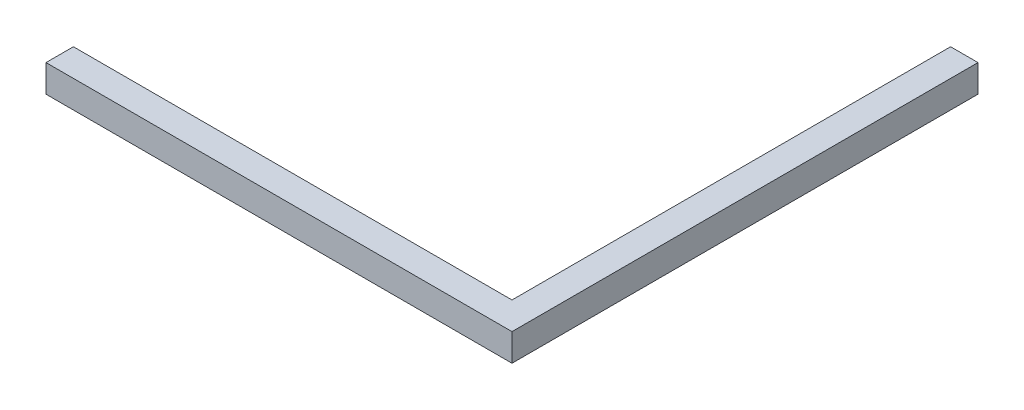
ISO-10303-21;
HEADER;
FILE_DESCRIPTION(('STEP AP214'),'2;1');
FILE_NAME('part.step','',(''),(''),'','','');
FILE_SCHEMA(('AUTOMOTIVE_DESIGN { 1 0 10303 214 1 1 1 1 }'));
ENDSEC;
DATA;
#1=APPLICATION_CONTEXT('core data for automotive mechanical design processes');
#2=APPLICATION_PROTOCOL_DEFINITION('international standard','automotive_design',2000,#1);
#3=PRODUCT_CONTEXT('',#1,'mechanical');
#4=PRODUCT('Part','Part','',(#3));
#5=PRODUCT_RELATED_PRODUCT_CATEGORY('part','',(#4));
#6=PRODUCT_DEFINITION_FORMATION('','',#4);
#7=PRODUCT_DEFINITION_CONTEXT('part definition',#1,'design');
#8=PRODUCT_DEFINITION('design','',#6,#7);
#9=PRODUCT_DEFINITION_SHAPE('','',#8);
#10=(LENGTH_UNIT() NAMED_UNIT(*) SI_UNIT(.MILLI.,.METRE.));
#11=(NAMED_UNIT(*) PLANE_ANGLE_UNIT() SI_UNIT($,.RADIAN.));
#12=(NAMED_UNIT(*) SI_UNIT($,.STERADIAN.) SOLID_ANGLE_UNIT());
#13=UNCERTAINTY_MEASURE_WITH_UNIT(LENGTH_MEASURE(1.E-05),#10,'distance_accuracy_value','');
#14=(GEOMETRIC_REPRESENTATION_CONTEXT(3) GLOBAL_UNCERTAINTY_ASSIGNED_CONTEXT((#13)) GLOBAL_UNIT_ASSIGNED_CONTEXT((#10,
#11,#12)) REPRESENTATION_CONTEXT('',''));
#15=CARTESIAN_POINT('',(0.,0.,0.));
#16=DIRECTION('',(0.,0.,1.));
#17=DIRECTION('',(1.,0.,0.));
#18=AXIS2_PLACEMENT_3D('',#15,#16,#17);
#19=CARTESIAN_POINT('',(85.,10.,85.));
#20=DIRECTION('',(-1.,0.,0.));
#21=DIRECTION('',(0.,0.,1.));
#22=AXIS2_PLACEMENT_3D('',#19,#20,#21);
#23=PLANE('',#22);
#24=DIRECTION('',(0.,0.,-1.));
#25=VECTOR('',#24,1.);
#26=CARTESIAN_POINT('',(85.,0.,85.));
#27=LINE('',#26,#25);
#28=CARTESIAN_POINT('',(85.,0.,85.));
#29=VERTEX_POINT('',#28);
#30=CARTESIAN_POINT('',(85.,0.,-85.));
#31=VERTEX_POINT('',#30);
#32=EDGE_CURVE('E118',#29,#31,#27,.T.);
#33=ORIENTED_EDGE('',*,*,#32,.T.);
#34=DIRECTION('',(0.,-1.,0.));
#35=VECTOR('',#34,1.);
#36=CARTESIAN_POINT('',(85.,10.,-85.));
#37=LINE('',#36,#35);
#38=CARTESIAN_POINT('',(85.,10.,-85.));
#39=VERTEX_POINT('',#38);
#40=EDGE_CURVE('E11',#39,#31,#37,.T.);
#41=ORIENTED_EDGE('',*,*,#40,.F.);
#42=DIRECTION('',(0.,0.,-1.));
#43=VECTOR('',#42,1.);
#44=CARTESIAN_POINT('',(85.,10.,85.));
#45=LINE('',#44,#43);
#46=CARTESIAN_POINT('',(85.,10.,85.));
#47=VERTEX_POINT('',#46);
#48=EDGE_CURVE('E128',#47,#39,#45,.T.);
#49=ORIENTED_EDGE('',*,*,#48,.F.);
#50=DIRECTION('',(0.,-1.,0.));
#51=VECTOR('',#50,1.);
#52=CARTESIAN_POINT('',(85.,10.,85.));
#53=LINE('',#52,#51);
#54=EDGE_CURVE('E114',#47,#29,#53,.T.);
#55=ORIENTED_EDGE('',*,*,#54,.T.);
#56=EDGE_LOOP('',(#33,#41,#49,#55));
#57=FACE_BOUND('',#56,.T.);
#58=ADVANCED_FACE('F34',(#57),#23,.F.);
#59=CARTESIAN_POINT('',(85.,10.,-85.));
#60=DIRECTION('',(0.,0.,1.));
#61=DIRECTION('',(1.,0.,0.));
#62=AXIS2_PLACEMENT_3D('',#59,#60,#61);
#63=PLANE('',#62);
#64=DIRECTION('',(-1.,0.,0.));
#65=VECTOR('',#64,1.);
#66=CARTESIAN_POINT('',(85.,0.,-85.));
#67=LINE('',#66,#65);
#68=CARTESIAN_POINT('',(75.,0.,-85.));
#69=VERTEX_POINT('',#68);
#70=EDGE_CURVE('E121',#31,#69,#67,.T.);
#71=ORIENTED_EDGE('',*,*,#70,.T.);
#72=DIRECTION('',(0.,-1.,0.));
#73=VECTOR('',#72,1.);
#74=CARTESIAN_POINT('',(75.,10.,-85.));
#75=LINE('',#74,#73);
#76=CARTESIAN_POINT('',(75.,10.,-85.));
#77=VERTEX_POINT('',#76);
#78=EDGE_CURVE('E42',#77,#69,#75,.T.);
#79=ORIENTED_EDGE('',*,*,#78,.F.);
#80=DIRECTION('',(-1.,0.,0.));
#81=VECTOR('',#80,1.);
#82=CARTESIAN_POINT('',(85.,10.,-85.));
#83=LINE('',#82,#81);
#84=EDGE_CURVE('E87',#39,#77,#83,.T.);
#85=ORIENTED_EDGE('',*,*,#84,.F.);
#86=ORIENTED_EDGE('',*,*,#40,.T.);
#87=EDGE_LOOP('',(#71,#79,#85,#86));
#88=FACE_BOUND('',#87,.T.);
#89=ADVANCED_FACE('F152',(#88),#63,.F.);
#90=CARTESIAN_POINT('',(75.,10.,-85.));
#91=DIRECTION('',(1.,0.,0.));
#92=DIRECTION('',(0.,0.,-1.));
#93=AXIS2_PLACEMENT_3D('',#90,#91,#92);
#94=PLANE('',#93);
#95=DIRECTION('',(0.,0.,1.));
#96=VECTOR('',#95,1.);
#97=CARTESIAN_POINT('',(75.,0.,-85.));
#98=LINE('',#97,#96);
#99=CARTESIAN_POINT('',(75.,0.,75.));
#100=VERTEX_POINT('',#99);
#101=EDGE_CURVE('E123',#69,#100,#98,.T.);
#102=ORIENTED_EDGE('',*,*,#101,.T.);
#103=DIRECTION('',(0.,-1.,0.));
#104=VECTOR('',#103,1.);
#105=CARTESIAN_POINT('',(75.,10.,75.));
#106=LINE('',#105,#104);
#107=CARTESIAN_POINT('',(75.,10.,75.));
#108=VERTEX_POINT('',#107);
#109=EDGE_CURVE('E109',#108,#100,#106,.T.);
#110=ORIENTED_EDGE('',*,*,#109,.F.);
#111=DIRECTION('',(0.,0.,1.));
#112=VECTOR('',#111,1.);
#113=CARTESIAN_POINT('',(75.,10.,-85.));
#114=LINE('',#113,#112);
#115=EDGE_CURVE('E100',#77,#108,#114,.T.);
#116=ORIENTED_EDGE('',*,*,#115,.F.);
#117=ORIENTED_EDGE('',*,*,#78,.T.);
#118=EDGE_LOOP('',(#102,#110,#116,#117));
#119=FACE_BOUND('',#118,.T.);
#120=ADVANCED_FACE('F134',(#119),#94,.F.);
#121=CARTESIAN_POINT('',(75.,10.,75.));
#122=DIRECTION('',(0.,0.,1.));
#123=DIRECTION('',(1.,0.,0.));
#124=AXIS2_PLACEMENT_3D('',#121,#122,#123);
#125=PLANE('',#124);
#126=DIRECTION('',(-1.,0.,0.));
#127=VECTOR('',#126,1.);
#128=CARTESIAN_POINT('',(75.,0.,75.));
#129=LINE('',#128,#127);
#130=CARTESIAN_POINT('',(-85.,0.,75.));
#131=VERTEX_POINT('',#130);
#132=EDGE_CURVE('E108',#100,#131,#129,.T.);
#133=ORIENTED_EDGE('',*,*,#132,.T.);
#134=DIRECTION('',(0.,-1.,0.));
#135=VECTOR('',#134,1.);
#136=CARTESIAN_POINT('',(-85.,10.,75.));
#137=LINE('',#136,#135);
#138=CARTESIAN_POINT('',(-85.,10.,75.));
#139=VERTEX_POINT('',#138);
#140=EDGE_CURVE('E105',#139,#131,#137,.T.);
#141=ORIENTED_EDGE('',*,*,#140,.F.);
#142=DIRECTION('',(-1.,0.,0.));
#143=VECTOR('',#142,1.);
#144=CARTESIAN_POINT('',(75.,10.,75.));
#145=LINE('',#144,#143);
#146=EDGE_CURVE('E94',#108,#139,#145,.T.);
#147=ORIENTED_EDGE('',*,*,#146,.F.);
#148=ORIENTED_EDGE('',*,*,#109,.T.);
#149=EDGE_LOOP('',(#133,#141,#147,#148));
#150=FACE_BOUND('',#149,.T.);
#151=ADVANCED_FACE('F106',(#150),#125,.F.);
#152=CARTESIAN_POINT('',(-85.,10.,75.));
#153=DIRECTION('',(1.,0.,0.));
#154=DIRECTION('',(0.,0.,-1.));
#155=AXIS2_PLACEMENT_3D('',#152,#153,#154);
#156=PLANE('',#155);
#157=DIRECTION('',(0.,0.,1.));
#158=VECTOR('',#157,1.);
#159=CARTESIAN_POINT('',(-85.,0.,75.));
#160=LINE('',#159,#158);
#161=CARTESIAN_POINT('',(-85.,0.,85.));
#162=VERTEX_POINT('',#161);
#163=EDGE_CURVE('E73',#131,#162,#160,.T.);
#164=ORIENTED_EDGE('',*,*,#163,.T.);
#165=DIRECTION('',(0.,-1.,0.));
#166=VECTOR('',#165,1.);
#167=CARTESIAN_POINT('',(-85.,10.,85.));
#168=LINE('',#167,#166);
#169=CARTESIAN_POINT('',(-85.,10.,85.));
#170=VERTEX_POINT('',#169);
#171=EDGE_CURVE('E110',#170,#162,#168,.T.);
#172=ORIENTED_EDGE('',*,*,#171,.F.);
#173=DIRECTION('',(0.,0.,1.));
#174=VECTOR('',#173,1.);
#175=CARTESIAN_POINT('',(-85.,10.,75.));
#176=LINE('',#175,#174);
#177=EDGE_CURVE('E98',#139,#170,#176,.T.);
#178=ORIENTED_EDGE('',*,*,#177,.F.);
#179=ORIENTED_EDGE('',*,*,#140,.T.);
#180=EDGE_LOOP('',(#164,#172,#178,#179));
#181=FACE_BOUND('',#180,.T.);
#182=ADVANCED_FACE('F112',(#181),#156,.F.);
#183=CARTESIAN_POINT('',(-85.,10.,85.));
#184=DIRECTION('',(0.,0.,-1.));
#185=DIRECTION('',(-1.,0.,0.));
#186=AXIS2_PLACEMENT_3D('',#183,#184,#185);
#187=PLANE('',#186);
#188=DIRECTION('',(1.,0.,0.));
#189=VECTOR('',#188,1.);
#190=CARTESIAN_POINT('',(-85.,0.,85.));
#191=LINE('',#190,#189);
#192=EDGE_CURVE('E79',#162,#29,#191,.T.);
#193=ORIENTED_EDGE('',*,*,#192,.T.);
#194=ORIENTED_EDGE('',*,*,#54,.F.);
#195=DIRECTION('',(1.,0.,0.));
#196=VECTOR('',#195,1.);
#197=CARTESIAN_POINT('',(-85.,10.,85.));
#198=LINE('',#197,#196);
#199=EDGE_CURVE('E50',#170,#47,#198,.T.);
#200=ORIENTED_EDGE('',*,*,#199,.F.);
#201=ORIENTED_EDGE('',*,*,#171,.T.);
#202=EDGE_LOOP('',(#193,#194,#200,#201));
#203=FACE_BOUND('',#202,.T.);
#204=ADVANCED_FACE('F141',(#203),#187,.F.);
#205=CARTESIAN_POINT('',(0.,10.,0.));
#206=DIRECTION('',(0.,1.,0.));
#207=DIRECTION('',(0.,0.,1.));
#208=AXIS2_PLACEMENT_3D('',#205,#206,#207);
#209=PLANE('',#208);
#210=ORIENTED_EDGE('',*,*,#48,.T.);
#211=ORIENTED_EDGE('',*,*,#84,.T.);
#212=ORIENTED_EDGE('',*,*,#115,.T.);
#213=ORIENTED_EDGE('',*,*,#146,.T.);
#214=ORIENTED_EDGE('',*,*,#177,.T.);
#215=ORIENTED_EDGE('',*,*,#199,.T.);
#216=EDGE_LOOP('',(#210,#211,#212,#213,#214,#215));
#217=FACE_BOUND('',#216,.T.);
#218=ADVANCED_FACE('F96',(#217),#209,.T.);
#219=CARTESIAN_POINT('',(0.,0.,0.));
#220=DIRECTION('',(0.,1.,0.));
#221=DIRECTION('',(0.,0.,1.));
#222=AXIS2_PLACEMENT_3D('',#219,#220,#221);
#223=PLANE('',#222);
#224=ORIENTED_EDGE('',*,*,#32,.F.);
#225=ORIENTED_EDGE('',*,*,#192,.F.);
#226=ORIENTED_EDGE('',*,*,#163,.F.);
#227=ORIENTED_EDGE('',*,*,#132,.F.);
#228=ORIENTED_EDGE('',*,*,#101,.F.);
#229=ORIENTED_EDGE('',*,*,#70,.F.);
#230=EDGE_LOOP('',(#224,#225,#226,#227,#228,#229));
#231=FACE_BOUND('',#230,.T.);
#232=ADVANCED_FACE('F137',(#231),#223,.F.);
#233=CLOSED_SHELL('',(#58,#89,#120,#151,#182,#204,#218,#232));
#234=MANIFOLD_SOLID_BREP('B2',#233);
#235=ADVANCED_BREP_SHAPE_REPRESENTATION('',(#18,#234),#14);
#236=SHAPE_DEFINITION_REPRESENTATION(#9,#235);
ENDSEC;
END-ISO-10303-21;
